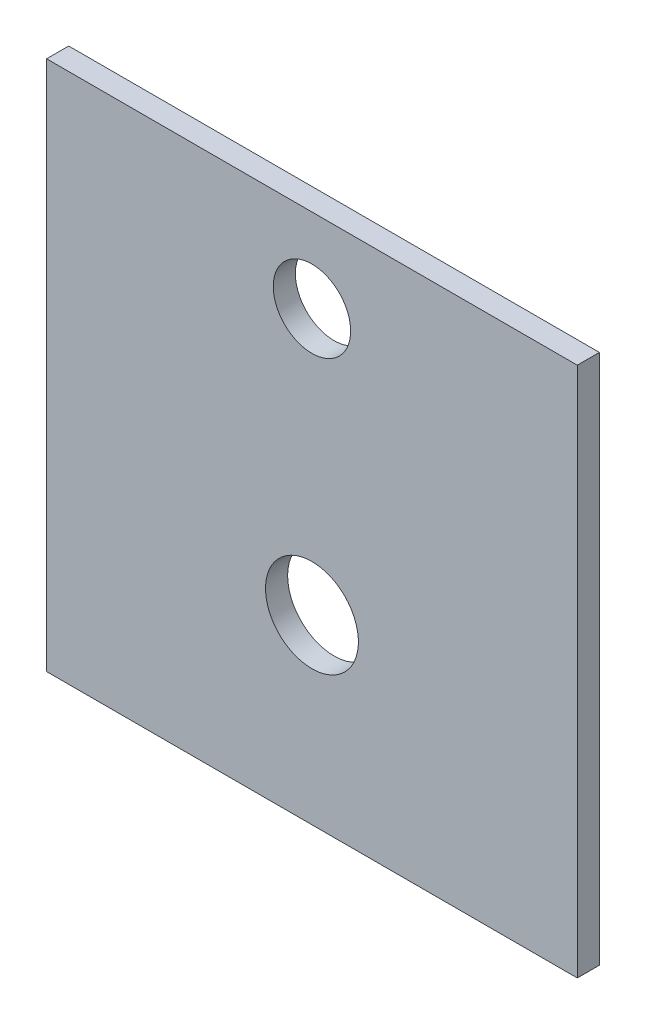
ISO-10303-21;
HEADER;
FILE_DESCRIPTION(('STEP AP214'),'2;1');
FILE_NAME('part.step','',(''),(''),'','','');
FILE_SCHEMA(('AUTOMOTIVE_DESIGN { 1 0 10303 214 1 1 1 1 }'));
ENDSEC;
DATA;
#1=APPLICATION_CONTEXT('core data for automotive mechanical design processes');
#2=APPLICATION_PROTOCOL_DEFINITION('international standard','automotive_design',2000,#1);
#3=PRODUCT_CONTEXT('',#1,'mechanical');
#4=PRODUCT('Part','Part','',(#3));
#5=PRODUCT_RELATED_PRODUCT_CATEGORY('part','',(#4));
#6=PRODUCT_DEFINITION_FORMATION('','',#4);
#7=PRODUCT_DEFINITION_CONTEXT('part definition',#1,'design');
#8=PRODUCT_DEFINITION('design','',#6,#7);
#9=PRODUCT_DEFINITION_SHAPE('','',#8);
#10=(LENGTH_UNIT() NAMED_UNIT(*) SI_UNIT(.MILLI.,.METRE.));
#11=(NAMED_UNIT(*) PLANE_ANGLE_UNIT() SI_UNIT($,.RADIAN.));
#12=(NAMED_UNIT(*) SI_UNIT($,.STERADIAN.) SOLID_ANGLE_UNIT());
#13=UNCERTAINTY_MEASURE_WITH_UNIT(LENGTH_MEASURE(1.E-05),#10,'distance_accuracy_value','');
#14=(GEOMETRIC_REPRESENTATION_CONTEXT(3) GLOBAL_UNCERTAINTY_ASSIGNED_CONTEXT((#13)) GLOBAL_UNIT_ASSIGNED_CONTEXT((#10,
#11,#12)) REPRESENTATION_CONTEXT('',''));
#15=CARTESIAN_POINT('',(0.,0.,0.));
#16=DIRECTION('',(0.,0.,1.));
#17=DIRECTION('',(1.,0.,0.));
#18=AXIS2_PLACEMENT_3D('',#15,#16,#17);
#19=CARTESIAN_POINT('',(0.,0.,-1.));
#20=DIRECTION('',(-1.,0.,0.));
#21=DIRECTION('',(0.,0.,1.));
#22=AXIS2_PLACEMENT_3D('',#19,#20,#21);
#23=PLANE('',#22);
#24=DIRECTION('',(0.,-1.,0.));
#25=VECTOR('',#24,1.);
#26=CARTESIAN_POINT('',(0.,0.,0.));
#27=LINE('',#26,#25);
#28=CARTESIAN_POINT('',(0.,24.,0.));
#29=VERTEX_POINT('',#28);
#30=CARTESIAN_POINT('',(0.,0.,0.));
#31=VERTEX_POINT('',#30);
#32=EDGE_CURVE('E104',#29,#31,#27,.T.);
#33=ORIENTED_EDGE('',*,*,#32,.F.);
#34=DIRECTION('',(0.,0.,1.));
#35=VECTOR('',#34,1.);
#36=CARTESIAN_POINT('',(0.,24.,-1.));
#37=LINE('',#36,#35);
#38=CARTESIAN_POINT('',(0.,24.,-1.));
#39=VERTEX_POINT('',#38);
#40=EDGE_CURVE('E11',#39,#29,#37,.T.);
#41=ORIENTED_EDGE('',*,*,#40,.F.);
#42=DIRECTION('',(0.,-1.,0.));
#43=VECTOR('',#42,1.);
#44=CARTESIAN_POINT('',(0.,0.,-1.));
#45=LINE('',#44,#43);
#46=CARTESIAN_POINT('',(0.,0.,-1.));
#47=VERTEX_POINT('',#46);
#48=EDGE_CURVE('E97',#39,#47,#45,.T.);
#49=ORIENTED_EDGE('',*,*,#48,.T.);
#50=DIRECTION('',(0.,0.,1.));
#51=VECTOR('',#50,1.);
#52=CARTESIAN_POINT('',(0.,0.,-1.));
#53=LINE('',#52,#51);
#54=EDGE_CURVE('E80',#47,#31,#53,.T.);
#55=ORIENTED_EDGE('',*,*,#54,.T.);
#56=EDGE_LOOP('',(#33,#41,#49,#55));
#57=FACE_BOUND('',#56,.T.);
#58=ADVANCED_FACE('F37',(#57),#23,.T.);
#59=CARTESIAN_POINT('',(0.,24.,-1.));
#60=DIRECTION('',(0.,1.,0.));
#61=DIRECTION('',(0.,0.,1.));
#62=AXIS2_PLACEMENT_3D('',#59,#60,#61);
#63=PLANE('',#62);
#64=DIRECTION('',(-1.,0.,0.));
#65=VECTOR('',#64,1.);
#66=CARTESIAN_POINT('',(0.,24.,0.));
#67=LINE('',#66,#65);
#68=CARTESIAN_POINT('',(24.,24.,0.));
#69=VERTEX_POINT('',#68);
#70=EDGE_CURVE('E99',#69,#29,#67,.T.);
#71=ORIENTED_EDGE('',*,*,#70,.F.);
#72=DIRECTION('',(0.,0.,1.));
#73=VECTOR('',#72,1.);
#74=CARTESIAN_POINT('',(24.,24.,-1.));
#75=LINE('',#74,#73);
#76=CARTESIAN_POINT('',(24.,24.,-1.));
#77=VERTEX_POINT('',#76);
#78=EDGE_CURVE('E46',#77,#69,#75,.T.);
#79=ORIENTED_EDGE('',*,*,#78,.F.);
#80=DIRECTION('',(-1.,0.,0.));
#81=VECTOR('',#80,1.);
#82=CARTESIAN_POINT('',(0.,24.,-1.));
#83=LINE('',#82,#81);
#84=EDGE_CURVE('E94',#77,#39,#83,.T.);
#85=ORIENTED_EDGE('',*,*,#84,.T.);
#86=ORIENTED_EDGE('',*,*,#40,.T.);
#87=EDGE_LOOP('',(#71,#79,#85,#86));
#88=FACE_BOUND('',#87,.T.);
#89=ADVANCED_FACE('F142',(#88),#63,.T.);
#90=CARTESIAN_POINT('',(24.,0.,-1.));
#91=DIRECTION('',(1.,0.,0.));
#92=DIRECTION('',(0.,0.,-1.));
#93=AXIS2_PLACEMENT_3D('',#90,#91,#92);
#94=PLANE('',#93);
#95=DIRECTION('',(0.,1.,0.));
#96=VECTOR('',#95,1.);
#97=CARTESIAN_POINT('',(24.,0.,0.));
#98=LINE('',#97,#96);
#99=CARTESIAN_POINT('',(24.,0.,0.));
#100=VERTEX_POINT('',#99);
#101=EDGE_CURVE('E88',#100,#69,#98,.T.);
#102=ORIENTED_EDGE('',*,*,#101,.F.);
#103=DIRECTION('',(0.,0.,1.));
#104=VECTOR('',#103,1.);
#105=CARTESIAN_POINT('',(24.,0.,-1.));
#106=LINE('',#105,#104);
#107=CARTESIAN_POINT('',(24.,0.,-1.));
#108=VERTEX_POINT('',#107);
#109=EDGE_CURVE('E83',#108,#100,#106,.T.);
#110=ORIENTED_EDGE('',*,*,#109,.F.);
#111=DIRECTION('',(0.,1.,0.));
#112=VECTOR('',#111,1.);
#113=CARTESIAN_POINT('',(24.,0.,-1.));
#114=LINE('',#113,#112);
#115=EDGE_CURVE('E86',#108,#77,#114,.T.);
#116=ORIENTED_EDGE('',*,*,#115,.T.);
#117=ORIENTED_EDGE('',*,*,#78,.T.);
#118=EDGE_LOOP('',(#102,#110,#116,#117));
#119=FACE_BOUND('',#118,.T.);
#120=ADVANCED_FACE('F85',(#119),#94,.T.);
#121=CARTESIAN_POINT('',(0.,0.,-1.));
#122=DIRECTION('',(0.,-1.,0.));
#123=DIRECTION('',(0.,0.,-1.));
#124=AXIS2_PLACEMENT_3D('',#121,#122,#123);
#125=PLANE('',#124);
#126=DIRECTION('',(1.,0.,0.));
#127=VECTOR('',#126,1.);
#128=CARTESIAN_POINT('',(0.,0.,0.));
#129=LINE('',#128,#127);
#130=EDGE_CURVE('E107',#31,#100,#129,.T.);
#131=ORIENTED_EDGE('',*,*,#130,.F.);
#132=ORIENTED_EDGE('',*,*,#54,.F.);
#133=DIRECTION('',(1.,0.,0.));
#134=VECTOR('',#133,1.);
#135=CARTESIAN_POINT('',(0.,0.,-1.));
#136=LINE('',#135,#134);
#137=EDGE_CURVE('E93',#47,#108,#136,.T.);
#138=ORIENTED_EDGE('',*,*,#137,.T.);
#139=ORIENTED_EDGE('',*,*,#109,.T.);
#140=EDGE_LOOP('',(#131,#132,#138,#139));
#141=FACE_BOUND('',#140,.T.);
#142=ADVANCED_FACE('F96',(#141),#125,.T.);
#143=CARTESIAN_POINT('',(0.,0.,-1.));
#144=DIRECTION('',(0.,0.,-1.));
#145=DIRECTION('',(-1.,0.,0.));
#146=AXIS2_PLACEMENT_3D('',#143,#144,#145);
#147=PLANE('',#146);
#148=CARTESIAN_POINT('',(12.,20.2108125993359,-1.));
#149=DIRECTION('',(0.,0.,-1.));
#150=DIRECTION('',(-1.,0.,0.));
#151=AXIS2_PLACEMENT_3D('',#148,#149,#150);
#152=CIRCLE('',#151,1.75);
#153=CARTESIAN_POINT('',(10.25,20.2108125993359,-1.));
#154=VERTEX_POINT('',#153);
#155=EDGE_CURVE('E115',#154,#154,#152,.T.);
#156=ORIENTED_EDGE('',*,*,#155,.F.);
#157=EDGE_LOOP('',(#156));
#158=FACE_BOUND('',#157,.T.);
#159=CARTESIAN_POINT('',(12.,8.21081259933595,-1.));
#160=DIRECTION('',(0.,0.,-1.));
#161=DIRECTION('',(-1.,0.,0.));
#162=AXIS2_PLACEMENT_3D('',#159,#160,#161);
#163=CIRCLE('',#162,2.1);
#164=CARTESIAN_POINT('',(9.89999999999998,8.21081259933595,-1.));
#165=VERTEX_POINT('',#164);
#166=EDGE_CURVE('E120',#165,#165,#163,.T.);
#167=ORIENTED_EDGE('',*,*,#166,.F.);
#168=EDGE_LOOP('',(#167));
#169=FACE_BOUND('',#168,.T.);
#170=ORIENTED_EDGE('',*,*,#48,.F.);
#171=ORIENTED_EDGE('',*,*,#84,.F.);
#172=ORIENTED_EDGE('',*,*,#115,.F.);
#173=ORIENTED_EDGE('',*,*,#137,.F.);
#174=EDGE_LOOP('',(#170,#171,#172,#173));
#175=FACE_BOUND('',#174,.T.);
#176=ADVANCED_FACE('F92',(#158,#169,#175),#147,.T.);
#177=CARTESIAN_POINT('',(0.,0.,0.));
#178=DIRECTION('',(0.,0.,-1.));
#179=DIRECTION('',(-1.,0.,0.));
#180=AXIS2_PLACEMENT_3D('',#177,#178,#179);
#181=PLANE('',#180);
#182=CARTESIAN_POINT('',(12.,20.2108125993359,0.));
#183=DIRECTION('',(0.,0.,-1.));
#184=DIRECTION('',(-1.,0.,0.));
#185=AXIS2_PLACEMENT_3D('',#182,#183,#184);
#186=CIRCLE('',#185,1.75);
#187=CARTESIAN_POINT('',(10.25,20.2108125993359,0.));
#188=VERTEX_POINT('',#187);
#189=EDGE_CURVE('E40',#188,#188,#186,.T.);
#190=ORIENTED_EDGE('',*,*,#189,.T.);
#191=EDGE_LOOP('',(#190));
#192=FACE_BOUND('',#191,.T.);
#193=CARTESIAN_POINT('',(12.,8.21081259933595,0.));
#194=DIRECTION('',(0.,0.,-1.));
#195=DIRECTION('',(-1.,0.,0.));
#196=AXIS2_PLACEMENT_3D('',#193,#194,#195);
#197=CIRCLE('',#196,2.1);
#198=CARTESIAN_POINT('',(9.89999999999998,8.21081259933595,0.));
#199=VERTEX_POINT('',#198);
#200=EDGE_CURVE('E113',#199,#199,#197,.T.);
#201=ORIENTED_EDGE('',*,*,#200,.T.);
#202=EDGE_LOOP('',(#201));
#203=FACE_BOUND('',#202,.T.);
#204=ORIENTED_EDGE('',*,*,#32,.T.);
#205=ORIENTED_EDGE('',*,*,#130,.T.);
#206=ORIENTED_EDGE('',*,*,#101,.T.);
#207=ORIENTED_EDGE('',*,*,#70,.T.);
#208=EDGE_LOOP('',(#204,#205,#206,#207));
#209=FACE_BOUND('',#208,.T.);
#210=ADVANCED_FACE('F131',(#192,#203,#209),#181,.F.);
#211=CARTESIAN_POINT('',(12.,8.21081259933595,9.));
#212=DIRECTION('',(0.,0.,-1.));
#213=DIRECTION('',(-1.,0.,0.));
#214=AXIS2_PLACEMENT_3D('',#211,#212,#213);
#215=CYLINDRICAL_SURFACE('',#214,2.1);
#216=ORIENTED_EDGE('',*,*,#166,.T.);
#217=EDGE_LOOP('',(#216));
#218=FACE_BOUND('',#217,.T.);
#219=ORIENTED_EDGE('',*,*,#200,.F.);
#220=EDGE_LOOP('',(#219));
#221=FACE_BOUND('',#220,.T.);
#222=ADVANCED_FACE('F127',(#218,#221),#215,.F.);
#223=CARTESIAN_POINT('',(12.,20.2108125993359,9.));
#224=DIRECTION('',(0.,0.,-1.));
#225=DIRECTION('',(-1.,0.,0.));
#226=AXIS2_PLACEMENT_3D('',#223,#224,#225);
#227=CYLINDRICAL_SURFACE('',#226,1.75);
#228=ORIENTED_EDGE('',*,*,#155,.T.);
#229=EDGE_LOOP('',(#228));
#230=FACE_BOUND('',#229,.T.);
#231=ORIENTED_EDGE('',*,*,#189,.F.);
#232=EDGE_LOOP('',(#231));
#233=FACE_BOUND('',#232,.T.);
#234=ADVANCED_FACE('F180',(#230,#233),#227,.F.);
#235=CLOSED_SHELL('',(#58,#89,#120,#142,#176,#210,#222,#234));
#236=MANIFOLD_SOLID_BREP('B2',#235);
#237=ADVANCED_BREP_SHAPE_REPRESENTATION('',(#18,#236),#14);
#238=SHAPE_DEFINITION_REPRESENTATION(#9,#237);
ENDSEC;
END-ISO-10303-21;
